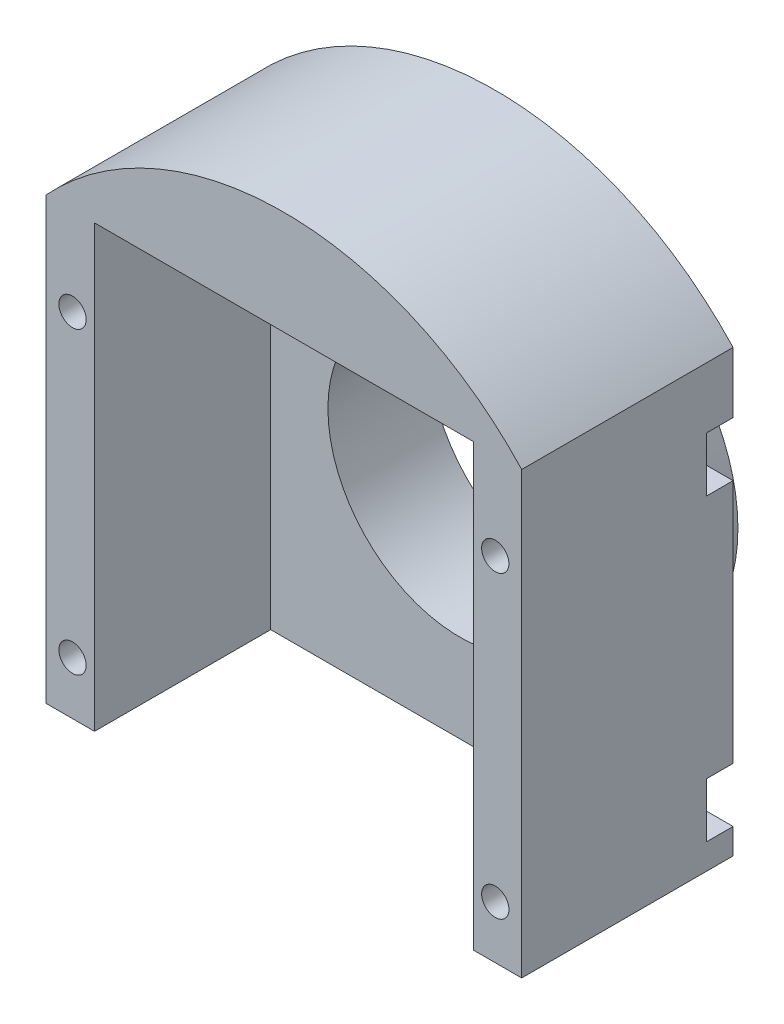
ISO-10303-21;
HEADER;
FILE_DESCRIPTION(('STEP AP214'),'2;1');
FILE_NAME('part.step','',(''),(''),'','','');
FILE_SCHEMA(('AUTOMOTIVE_DESIGN { 1 0 10303 214 1 1 1 1 }'));
ENDSEC;
DATA;
#1=APPLICATION_CONTEXT('core data for automotive mechanical design processes');
#2=APPLICATION_PROTOCOL_DEFINITION('international standard','automotive_design',2000,#1);
#3=PRODUCT_CONTEXT('',#1,'mechanical');
#4=PRODUCT('Part','Part','',(#3));
#5=PRODUCT_RELATED_PRODUCT_CATEGORY('part','',(#4));
#6=PRODUCT_DEFINITION_FORMATION('','',#4);
#7=PRODUCT_DEFINITION_CONTEXT('part definition',#1,'design');
#8=PRODUCT_DEFINITION('design','',#6,#7);
#9=PRODUCT_DEFINITION_SHAPE('','',#8);
#10=(LENGTH_UNIT() NAMED_UNIT(*) SI_UNIT(.MILLI.,.METRE.));
#11=(NAMED_UNIT(*) PLANE_ANGLE_UNIT() SI_UNIT($,.RADIAN.));
#12=(NAMED_UNIT(*) SI_UNIT($,.STERADIAN.) SOLID_ANGLE_UNIT());
#13=UNCERTAINTY_MEASURE_WITH_UNIT(LENGTH_MEASURE(1.E-05),#10,'distance_accuracy_value','');
#14=(GEOMETRIC_REPRESENTATION_CONTEXT(3) GLOBAL_UNCERTAINTY_ASSIGNED_CONTEXT((#13)) GLOBAL_UNIT_ASSIGNED_CONTEXT((#10,
#11,#12)) REPRESENTATION_CONTEXT('',''));
#15=CARTESIAN_POINT('',(0.,0.,0.));
#16=DIRECTION('',(0.,0.,1.));
#17=DIRECTION('',(1.,0.,0.));
#18=AXIS2_PLACEMENT_3D('',#15,#16,#17);
#19=CARTESIAN_POINT('',(0.,0.,0.));
#20=DIRECTION('',(0.,0.,1.));
#21=DIRECTION('',(1.,0.,0.));
#22=AXIS2_PLACEMENT_3D('',#19,#20,#21);
#23=PLANE('',#22);
#24=CARTESIAN_POINT('',(0.,0.,0.));
#25=DIRECTION('',(0.,0.,1.));
#26=DIRECTION('',(1.,0.,0.));
#27=AXIS2_PLACEMENT_3D('',#24,#25,#26);
#28=CIRCLE('',#27,21.);
#29=CARTESIAN_POINT('',(21.,0.,0.));
#30=VERTEX_POINT('',#29);
#31=EDGE_CURVE('E11',#30,#30,#28,.F.);
#32=ORIENTED_EDGE('',*,*,#31,.F.);
#33=EDGE_LOOP('',(#32));
#34=FACE_BOUND('',#33,.T.);
#35=DIRECTION('',(0.,1.,0.));
#36=VECTOR('',#35,1.);
#37=CARTESIAN_POINT('',(27.,25.,0.));
#38=LINE('',#37,#36);
#39=CARTESIAN_POINT('',(27.,18.1,0.));
#40=VERTEX_POINT('',#39);
#41=CARTESIAN_POINT('',(27.,25.,0.));
#42=VERTEX_POINT('',#41);
#43=EDGE_CURVE('E427',#40,#42,#38,.T.);
#44=ORIENTED_EDGE('',*,*,#43,.F.);
#45=DIRECTION('',(1.,0.,0.));
#46=VECTOR('',#45,1.);
#47=CARTESIAN_POINT('',(27.,18.1,0.));
#48=LINE('',#47,#46);
#49=CARTESIAN_POINT('',(24.,18.1,0.));
#50=VERTEX_POINT('',#49);
#51=EDGE_CURVE('E315',#50,#40,#48,.T.);
#52=ORIENTED_EDGE('',*,*,#51,.F.);
#53=CARTESIAN_POINT('',(24.,15.,0.));
#54=DIRECTION('',(0.,0.,-1.));
#55=DIRECTION('',(1.,0.,0.));
#56=AXIS2_PLACEMENT_3D('',#53,#54,#55);
#57=CIRCLE('',#56,3.1);
#58=CARTESIAN_POINT('',(24.,11.9,0.));
#59=VERTEX_POINT('',#58);
#60=EDGE_CURVE('E308',#59,#50,#57,.T.);
#61=ORIENTED_EDGE('',*,*,#60,.F.);
#62=DIRECTION('',(-1.,0.,0.));
#63=VECTOR('',#62,1.);
#64=CARTESIAN_POINT('',(24.,11.9,0.));
#65=LINE('',#64,#63);
#66=CARTESIAN_POINT('',(27.,11.9,0.));
#67=VERTEX_POINT('',#66);
#68=EDGE_CURVE('E311',#67,#59,#65,.T.);
#69=ORIENTED_EDGE('',*,*,#68,.F.);
#70=CARTESIAN_POINT('',(27.,-15.9,0.));
#71=VERTEX_POINT('',#70);
#72=EDGE_CURVE('E607',#71,#67,#38,.T.);
#73=ORIENTED_EDGE('',*,*,#72,.F.);
#74=DIRECTION('',(1.,0.,0.));
#75=VECTOR('',#74,1.);
#76=CARTESIAN_POINT('',(27.,-15.9,0.));
#77=LINE('',#76,#75);
#78=CARTESIAN_POINT('',(24.,-15.9,0.));
#79=VERTEX_POINT('',#78);
#80=EDGE_CURVE('E357',#79,#71,#77,.T.);
#81=ORIENTED_EDGE('',*,*,#80,.F.);
#82=CARTESIAN_POINT('',(24.,-19.,0.));
#83=DIRECTION('',(0.,0.,-1.));
#84=DIRECTION('',(1.,0.,0.));
#85=AXIS2_PLACEMENT_3D('',#82,#83,#84);
#86=CIRCLE('',#85,3.1);
#87=CARTESIAN_POINT('',(24.,-22.1,0.));
#88=VERTEX_POINT('',#87);
#89=EDGE_CURVE('E369',#88,#79,#86,.T.);
#90=ORIENTED_EDGE('',*,*,#89,.F.);
#91=DIRECTION('',(-1.,0.,0.));
#92=VECTOR('',#91,1.);
#93=CARTESIAN_POINT('',(24.,-22.1,0.));
#94=LINE('',#93,#92);
#95=CARTESIAN_POINT('',(27.,-22.1,0.));
#96=VERTEX_POINT('',#95);
#97=EDGE_CURVE('E317',#96,#88,#94,.T.);
#98=ORIENTED_EDGE('',*,*,#97,.F.);
#99=CARTESIAN_POINT('',(27.,-25.,0.));
#100=VERTEX_POINT('',#99);
#101=EDGE_CURVE('E232',#100,#96,#38,.T.);
#102=ORIENTED_EDGE('',*,*,#101,.F.);
#103=DIRECTION('',(1.,0.,0.));
#104=VECTOR('',#103,1.);
#105=CARTESIAN_POINT('',(-27.,-25.,0.));
#106=LINE('',#105,#104);
#107=CARTESIAN_POINT('',(-27.,-25.,0.));
#108=VERTEX_POINT('',#107);
#109=EDGE_CURVE('E231',#108,#100,#106,.T.);
#110=ORIENTED_EDGE('',*,*,#109,.F.);
#111=DIRECTION('',(0.,-1.,0.));
#112=VECTOR('',#111,1.);
#113=CARTESIAN_POINT('',(-27.,25.,0.));
#114=LINE('',#113,#112);
#115=CARTESIAN_POINT('',(-27.,-22.1,0.));
#116=VERTEX_POINT('',#115);
#117=EDGE_CURVE('E228',#116,#108,#114,.T.);
#118=ORIENTED_EDGE('',*,*,#117,.F.);
#119=DIRECTION('',(-1.,0.,0.));
#120=VECTOR('',#119,1.);
#121=CARTESIAN_POINT('',(-24.,-22.1,0.));
#122=LINE('',#121,#120);
#123=CARTESIAN_POINT('',(-24.,-22.1,0.));
#124=VERTEX_POINT('',#123);
#125=EDGE_CURVE('E336',#124,#116,#122,.T.);
#126=ORIENTED_EDGE('',*,*,#125,.F.);
#127=CARTESIAN_POINT('',(-24.,-19.,0.));
#128=DIRECTION('',(0.,0.,-1.));
#129=DIRECTION('',(-1.,0.,0.));
#130=AXIS2_PLACEMENT_3D('',#127,#128,#129);
#131=CIRCLE('',#130,3.1);
#132=CARTESIAN_POINT('',(-24.,-15.9,0.));
#133=VERTEX_POINT('',#132);
#134=EDGE_CURVE('E338',#133,#124,#131,.T.);
#135=ORIENTED_EDGE('',*,*,#134,.F.);
#136=DIRECTION('',(1.,0.,0.));
#137=VECTOR('',#136,1.);
#138=CARTESIAN_POINT('',(-27.,-15.9,0.));
#139=LINE('',#138,#137);
#140=CARTESIAN_POINT('',(-27.,-15.9,0.));
#141=VERTEX_POINT('',#140);
#142=EDGE_CURVE('E226',#141,#133,#139,.T.);
#143=ORIENTED_EDGE('',*,*,#142,.F.);
#144=CARTESIAN_POINT('',(-27.,11.9,0.));
#145=VERTEX_POINT('',#144);
#146=EDGE_CURVE('E220',#145,#141,#114,.T.);
#147=ORIENTED_EDGE('',*,*,#146,.F.);
#148=DIRECTION('',(-1.,0.,0.));
#149=VECTOR('',#148,1.);
#150=CARTESIAN_POINT('',(-24.,11.9,0.));
#151=LINE('',#150,#149);
#152=CARTESIAN_POINT('',(-24.,11.9,0.));
#153=VERTEX_POINT('',#152);
#154=EDGE_CURVE('E201',#153,#145,#151,.T.);
#155=ORIENTED_EDGE('',*,*,#154,.F.);
#156=CARTESIAN_POINT('',(-24.,15.,0.));
#157=DIRECTION('',(0.,0.,-1.));
#158=DIRECTION('',(-1.,0.,0.));
#159=AXIS2_PLACEMENT_3D('',#156,#157,#158);
#160=CIRCLE('',#159,3.1);
#161=CARTESIAN_POINT('',(-24.,18.1,0.));
#162=VERTEX_POINT('',#161);
#163=EDGE_CURVE('E212',#162,#153,#160,.T.);
#164=ORIENTED_EDGE('',*,*,#163,.F.);
#165=DIRECTION('',(1.,0.,0.));
#166=VECTOR('',#165,1.);
#167=CARTESIAN_POINT('',(-27.,18.1,0.));
#168=LINE('',#167,#166);
#169=CARTESIAN_POINT('',(-27.,18.1,0.));
#170=VERTEX_POINT('',#169);
#171=EDGE_CURVE('E287',#170,#162,#168,.T.);
#172=ORIENTED_EDGE('',*,*,#171,.F.);
#173=CARTESIAN_POINT('',(-27.,25.,0.));
#174=VERTEX_POINT('',#173);
#175=EDGE_CURVE('E227',#174,#170,#114,.T.);
#176=ORIENTED_EDGE('',*,*,#175,.F.);
#177=CARTESIAN_POINT('',(0.,-0.00479953928845048,0.));
#178=DIRECTION('',(0.,0.,1.));
#179=DIRECTION('',(1.,0.,0.));
#180=AXIS2_PLACEMENT_3D('',#177,#178,#179);
#181=CIRCLE('',#180,36.8);
#182=EDGE_CURVE('E410',#174,#42,#181,.F.);
#183=ORIENTED_EDGE('',*,*,#182,.T.);
#184=EDGE_LOOP('',(#44,#52,#61,#69,#73,#81,#90,#98,#102,#110,#118,#126,#135,#143,#147,#155,#164,
#172,#176,#183));
#185=FACE_BOUND('',#184,.T.);
#186=ADVANCED_FACE('F39',(#34,#185),#23,.F.);
#187=CARTESIAN_POINT('',(-24.,15.,0.));
#188=DIRECTION('',(0.,0.,1.));
#189=DIRECTION('',(1.,0.,0.));
#190=AXIS2_PLACEMENT_3D('',#187,#188,#189);
#191=CYLINDRICAL_SURFACE('',#190,1.55);
#192=CARTESIAN_POINT('',(-24.,15.,24.));
#193=DIRECTION('',(0.,0.,1.));
#194=DIRECTION('',(1.,0.,0.));
#195=AXIS2_PLACEMENT_3D('',#192,#193,#194);
#196=CIRCLE('',#195,1.55);
#197=CARTESIAN_POINT('',(-22.45,15.,24.));
#198=VERTEX_POINT('',#197);
#199=EDGE_CURVE('E419',#198,#198,#196,.T.);
#200=ORIENTED_EDGE('',*,*,#199,.T.);
#201=EDGE_LOOP('',(#200));
#202=FACE_BOUND('',#201,.T.);
#203=CARTESIAN_POINT('',(-24.,15.,3.));
#204=DIRECTION('',(0.,0.,-1.));
#205=DIRECTION('',(-1.,0.,0.));
#206=AXIS2_PLACEMENT_3D('',#203,#204,#205);
#207=CIRCLE('',#206,1.55);
#208=CARTESIAN_POINT('',(-25.55,15.,3.));
#209=VERTEX_POINT('',#208);
#210=EDGE_CURVE('E260',#209,#209,#207,.F.);
#211=ORIENTED_EDGE('',*,*,#210,.F.);
#212=EDGE_LOOP('',(#211));
#213=FACE_BOUND('',#212,.T.);
#214=ADVANCED_FACE('F477',(#202,#213),#191,.F.);
#215=CARTESIAN_POINT('',(-24.,-19.,0.));
#216=DIRECTION('',(0.,0.,1.));
#217=DIRECTION('',(1.,0.,0.));
#218=AXIS2_PLACEMENT_3D('',#215,#216,#217);
#219=CYLINDRICAL_SURFACE('',#218,1.55);
#220=CARTESIAN_POINT('',(-24.,-19.,24.));
#221=DIRECTION('',(0.,0.,1.));
#222=DIRECTION('',(1.,0.,0.));
#223=AXIS2_PLACEMENT_3D('',#220,#221,#222);
#224=CIRCLE('',#223,1.55);
#225=CARTESIAN_POINT('',(-22.45,-19.,24.));
#226=VERTEX_POINT('',#225);
#227=EDGE_CURVE('E413',#226,#226,#224,.T.);
#228=ORIENTED_EDGE('',*,*,#227,.T.);
#229=EDGE_LOOP('',(#228));
#230=FACE_BOUND('',#229,.T.);
#231=CARTESIAN_POINT('',(-24.,-19.,3.));
#232=DIRECTION('',(0.,0.,-1.));
#233=DIRECTION('',(-1.,0.,0.));
#234=AXIS2_PLACEMENT_3D('',#231,#232,#233);
#235=CIRCLE('',#234,1.55);
#236=CARTESIAN_POINT('',(-25.55,-19.,3.));
#237=VERTEX_POINT('',#236);
#238=EDGE_CURVE('E250',#237,#237,#235,.F.);
#239=ORIENTED_EDGE('',*,*,#238,.F.);
#240=EDGE_LOOP('',(#239));
#241=FACE_BOUND('',#240,.T.);
#242=ADVANCED_FACE('F483',(#230,#241),#219,.F.);
#243=CARTESIAN_POINT('',(-27.,-25.,24.));
#244=DIRECTION('',(0.,1.,0.));
#245=DIRECTION('',(0.,0.,1.));
#246=AXIS2_PLACEMENT_3D('',#243,#244,#245);
#247=PLANE('',#246);
#248=DIRECTION('',(0.,0.,1.));
#249=VECTOR('',#248,1.);
#250=CARTESIAN_POINT('',(21.5,-25.,4.));
#251=LINE('',#250,#249);
#252=CARTESIAN_POINT('',(21.5,-25.,4.));
#253=VERTEX_POINT('',#252);
#254=CARTESIAN_POINT('',(21.5,-25.,24.));
#255=VERTEX_POINT('',#254);
#256=EDGE_CURVE('E403',#253,#255,#251,.T.);
#257=ORIENTED_EDGE('',*,*,#256,.F.);
#258=DIRECTION('',(1.,0.,0.));
#259=VECTOR('',#258,1.);
#260=CARTESIAN_POINT('',(0.,-25.,4.));
#261=LINE('',#260,#259);
#262=CARTESIAN_POINT('',(-21.5,-25.,4.));
#263=VERTEX_POINT('',#262);
#264=EDGE_CURVE('E386',#263,#253,#261,.T.);
#265=ORIENTED_EDGE('',*,*,#264,.F.);
#266=DIRECTION('',(0.,0.,1.));
#267=VECTOR('',#266,1.);
#268=CARTESIAN_POINT('',(-21.5,-25.,4.));
#269=LINE('',#268,#267);
#270=CARTESIAN_POINT('',(-21.5,-25.,24.));
#271=VERTEX_POINT('',#270);
#272=EDGE_CURVE('E405',#263,#271,#269,.T.);
#273=ORIENTED_EDGE('',*,*,#272,.T.);
#274=DIRECTION('',(1.,0.,0.));
#275=VECTOR('',#274,1.);
#276=CARTESIAN_POINT('',(-27.,-25.,24.));
#277=LINE('',#276,#275);
#278=CARTESIAN_POINT('',(-27.,-25.,24.));
#279=VERTEX_POINT('',#278);
#280=EDGE_CURVE('E242',#279,#271,#277,.T.);
#281=ORIENTED_EDGE('',*,*,#280,.F.);
#282=DIRECTION('',(0.,0.,-1.));
#283=VECTOR('',#282,1.);
#284=CARTESIAN_POINT('',(-27.,-25.,24.));
#285=LINE('',#284,#283);
#286=EDGE_CURVE('E241',#279,#108,#285,.T.);
#287=ORIENTED_EDGE('',*,*,#286,.T.);
#288=ORIENTED_EDGE('',*,*,#109,.T.);
#289=DIRECTION('',(0.,0.,-1.));
#290=VECTOR('',#289,1.);
#291=CARTESIAN_POINT('',(27.,-25.,24.));
#292=LINE('',#291,#290);
#293=CARTESIAN_POINT('',(27.,-25.,24.));
#294=VERTEX_POINT('',#293);
#295=EDGE_CURVE('E238',#294,#100,#292,.T.);
#296=ORIENTED_EDGE('',*,*,#295,.F.);
#297=EDGE_CURVE('E430',#255,#294,#277,.T.);
#298=ORIENTED_EDGE('',*,*,#297,.F.);
#299=EDGE_LOOP('',(#257,#265,#273,#281,#287,#288,#296,#298));
#300=FACE_BOUND('',#299,.T.);
#301=ADVANCED_FACE('F441',(#300),#247,.F.);
#302=CARTESIAN_POINT('',(0.,0.,24.));
#303=DIRECTION('',(0.,0.,1.));
#304=DIRECTION('',(1.,0.,0.));
#305=AXIS2_PLACEMENT_3D('',#302,#303,#304);
#306=PLANE('',#305);
#307=ORIENTED_EDGE('',*,*,#227,.F.);
#308=EDGE_LOOP('',(#307));
#309=FACE_BOUND('',#308,.T.);
#310=CARTESIAN_POINT('',(24.,-19.,24.));
#311=DIRECTION('',(0.,0.,1.));
#312=DIRECTION('',(1.,0.,0.));
#313=AXIS2_PLACEMENT_3D('',#310,#311,#312);
#314=CIRCLE('',#313,1.55000000000001);
#315=CARTESIAN_POINT('',(25.55,-19.,24.));
#316=VERTEX_POINT('',#315);
#317=EDGE_CURVE('E420',#316,#316,#314,.T.);
#318=ORIENTED_EDGE('',*,*,#317,.F.);
#319=EDGE_LOOP('',(#318));
#320=FACE_BOUND('',#319,.T.);
#321=CARTESIAN_POINT('',(24.,15.,24.));
#322=DIRECTION('',(0.,0.,1.));
#323=DIRECTION('',(1.,0.,0.));
#324=AXIS2_PLACEMENT_3D('',#321,#322,#323);
#325=CIRCLE('',#324,1.55000000000001);
#326=CARTESIAN_POINT('',(25.55,15.,24.));
#327=VERTEX_POINT('',#326);
#328=EDGE_CURVE('E416',#327,#327,#325,.T.);
#329=ORIENTED_EDGE('',*,*,#328,.F.);
#330=EDGE_LOOP('',(#329));
#331=FACE_BOUND('',#330,.T.);
#332=ORIENTED_EDGE('',*,*,#199,.F.);
#333=EDGE_LOOP('',(#332));
#334=FACE_BOUND('',#333,.T.);
#335=DIRECTION('',(1.,0.,0.));
#336=VECTOR('',#335,1.);
#337=CARTESIAN_POINT('',(0.,25.,24.));
#338=LINE('',#337,#336);
#339=CARTESIAN_POINT('',(-21.5,25.,24.));
#340=VERTEX_POINT('',#339);
#341=CARTESIAN_POINT('',(21.5,25.,24.));
#342=VERTEX_POINT('',#341);
#343=EDGE_CURVE('E263',#340,#342,#338,.T.);
#344=ORIENTED_EDGE('',*,*,#343,.T.);
#345=DIRECTION('',(0.,-1.,0.));
#346=VECTOR('',#345,1.);
#347=CARTESIAN_POINT('',(21.5,0.,24.));
#348=LINE('',#347,#346);
#349=EDGE_CURVE('E384',#342,#255,#348,.T.);
#350=ORIENTED_EDGE('',*,*,#349,.T.);
#351=ORIENTED_EDGE('',*,*,#297,.T.);
#352=DIRECTION('',(0.,1.,0.));
#353=VECTOR('',#352,1.);
#354=CARTESIAN_POINT('',(27.,25.,24.));
#355=LINE('',#354,#353);
#356=CARTESIAN_POINT('',(27.,25.,24.));
#357=VERTEX_POINT('',#356);
#358=EDGE_CURVE('E237',#294,#357,#355,.T.);
#359=ORIENTED_EDGE('',*,*,#358,.T.);
#360=CARTESIAN_POINT('',(0.,-0.00479953928845048,24.));
#361=DIRECTION('',(0.,0.,1.));
#362=DIRECTION('',(-1.,0.,0.));
#363=AXIS2_PLACEMENT_3D('',#360,#361,#362);
#364=CIRCLE('',#363,36.8);
#365=CARTESIAN_POINT('',(-27.,25.,24.));
#366=VERTEX_POINT('',#365);
#367=EDGE_CURVE('E402',#357,#366,#364,.T.);
#368=ORIENTED_EDGE('',*,*,#367,.T.);
#369=DIRECTION('',(0.,-1.,0.));
#370=VECTOR('',#369,1.);
#371=CARTESIAN_POINT('',(-27.,25.,24.));
#372=LINE('',#371,#370);
#373=EDGE_CURVE('E429',#366,#279,#372,.T.);
#374=ORIENTED_EDGE('',*,*,#373,.T.);
#375=ORIENTED_EDGE('',*,*,#280,.T.);
#376=DIRECTION('',(0.,1.,0.));
#377=VECTOR('',#376,1.);
#378=CARTESIAN_POINT('',(-21.5,0.,24.));
#379=LINE('',#378,#377);
#380=EDGE_CURVE('E394',#271,#340,#379,.T.);
#381=ORIENTED_EDGE('',*,*,#380,.T.);
#382=EDGE_LOOP('',(#344,#350,#351,#359,#368,#374,#375,#381));
#383=FACE_BOUND('',#382,.T.);
#384=ADVANCED_FACE('F436',(#309,#320,#331,#334,#383),#306,.T.);
#385=CARTESIAN_POINT('',(27.,25.,24.));
#386=DIRECTION('',(-1.,0.,0.));
#387=DIRECTION('',(0.,0.,1.));
#388=AXIS2_PLACEMENT_3D('',#385,#386,#387);
#389=PLANE('',#388);
#390=DIRECTION('',(0.,-1.,0.));
#391=VECTOR('',#390,1.);
#392=CARTESIAN_POINT('',(27.,18.1,3.));
#393=LINE('',#392,#391);
#394=CARTESIAN_POINT('',(27.,18.1,3.));
#395=VERTEX_POINT('',#394);
#396=CARTESIAN_POINT('',(27.,11.9,3.));
#397=VERTEX_POINT('',#396);
#398=EDGE_CURVE('E323',#395,#397,#393,.T.);
#399=ORIENTED_EDGE('',*,*,#398,.F.);
#400=DIRECTION('',(0.,0.,-1.));
#401=VECTOR('',#400,1.);
#402=CARTESIAN_POINT('',(27.,18.1,3.));
#403=LINE('',#402,#401);
#404=EDGE_CURVE('E298',#395,#40,#403,.T.);
#405=ORIENTED_EDGE('',*,*,#404,.T.);
#406=ORIENTED_EDGE('',*,*,#43,.T.);
#407=DIRECTION('',(0.,0.,-1.));
#408=VECTOR('',#407,1.);
#409=CARTESIAN_POINT('',(27.,25.,24.));
#410=LINE('',#409,#408);
#411=EDGE_CURVE('E47',#357,#42,#410,.T.);
#412=ORIENTED_EDGE('',*,*,#411,.F.);
#413=ORIENTED_EDGE('',*,*,#358,.F.);
#414=ORIENTED_EDGE('',*,*,#295,.T.);
#415=ORIENTED_EDGE('',*,*,#101,.T.);
#416=DIRECTION('',(0.,0.,-1.));
#417=VECTOR('',#416,1.);
#418=CARTESIAN_POINT('',(27.,-22.1,3.));
#419=LINE('',#418,#417);
#420=CARTESIAN_POINT('',(27.,-22.1,3.));
#421=VERTEX_POINT('',#420);
#422=EDGE_CURVE('E366',#421,#96,#419,.T.);
#423=ORIENTED_EDGE('',*,*,#422,.F.);
#424=DIRECTION('',(0.,-1.,0.));
#425=VECTOR('',#424,1.);
#426=CARTESIAN_POINT('',(27.,-15.9,3.));
#427=LINE('',#426,#425);
#428=CARTESIAN_POINT('',(27.,-15.9,3.));
#429=VERTEX_POINT('',#428);
#430=EDGE_CURVE('E353',#429,#421,#427,.T.);
#431=ORIENTED_EDGE('',*,*,#430,.F.);
#432=DIRECTION('',(0.,0.,-1.));
#433=VECTOR('',#432,1.);
#434=CARTESIAN_POINT('',(27.,-15.9,3.));
#435=LINE('',#434,#433);
#436=EDGE_CURVE('E254',#429,#71,#435,.T.);
#437=ORIENTED_EDGE('',*,*,#436,.T.);
#438=ORIENTED_EDGE('',*,*,#72,.T.);
#439=DIRECTION('',(0.,0.,-1.));
#440=VECTOR('',#439,1.);
#441=CARTESIAN_POINT('',(27.,11.9,3.));
#442=LINE('',#441,#440);
#443=EDGE_CURVE('E302',#397,#67,#442,.T.);
#444=ORIENTED_EDGE('',*,*,#443,.F.);
#445=EDGE_LOOP('',(#399,#405,#406,#412,#413,#414,#415,#423,#431,#437,#438,#444));
#446=FACE_BOUND('',#445,.T.);
#447=ADVANCED_FACE('F41',(#446),#389,.F.);
#448=CARTESIAN_POINT('',(-27.,25.,24.));
#449=DIRECTION('',(1.,0.,0.));
#450=DIRECTION('',(0.,0.,-1.));
#451=AXIS2_PLACEMENT_3D('',#448,#449,#450);
#452=PLANE('',#451);
#453=DIRECTION('',(0.,1.,0.));
#454=VECTOR('',#453,1.);
#455=CARTESIAN_POINT('',(-27.,-15.9,3.));
#456=LINE('',#455,#454);
#457=CARTESIAN_POINT('',(-27.,-22.1,3.));
#458=VERTEX_POINT('',#457);
#459=CARTESIAN_POINT('',(-27.,-15.9,3.));
#460=VERTEX_POINT('',#459);
#461=EDGE_CURVE('E339',#458,#460,#456,.T.);
#462=ORIENTED_EDGE('',*,*,#461,.F.);
#463=DIRECTION('',(0.,0.,-1.));
#464=VECTOR('',#463,1.);
#465=CARTESIAN_POINT('',(-27.,-22.1,3.));
#466=LINE('',#465,#464);
#467=EDGE_CURVE('E289',#458,#116,#466,.T.);
#468=ORIENTED_EDGE('',*,*,#467,.T.);
#469=ORIENTED_EDGE('',*,*,#117,.T.);
#470=ORIENTED_EDGE('',*,*,#286,.F.);
#471=ORIENTED_EDGE('',*,*,#373,.F.);
#472=DIRECTION('',(0.,0.,-1.));
#473=VECTOR('',#472,1.);
#474=CARTESIAN_POINT('',(-27.,25.,24.));
#475=LINE('',#474,#473);
#476=EDGE_CURVE('E245',#366,#174,#475,.T.);
#477=ORIENTED_EDGE('',*,*,#476,.T.);
#478=ORIENTED_EDGE('',*,*,#175,.T.);
#479=DIRECTION('',(0.,0.,-1.));
#480=VECTOR('',#479,1.);
#481=CARTESIAN_POINT('',(-27.,18.1,3.));
#482=LINE('',#481,#480);
#483=CARTESIAN_POINT('',(-27.,18.1,3.));
#484=VERTEX_POINT('',#483);
#485=EDGE_CURVE('E62',#484,#170,#482,.T.);
#486=ORIENTED_EDGE('',*,*,#485,.F.);
#487=DIRECTION('',(0.,1.,0.));
#488=VECTOR('',#487,1.);
#489=CARTESIAN_POINT('',(-27.,18.1,3.));
#490=LINE('',#489,#488);
#491=CARTESIAN_POINT('',(-27.,11.9,3.));
#492=VERTEX_POINT('',#491);
#493=EDGE_CURVE('E213',#492,#484,#490,.T.);
#494=ORIENTED_EDGE('',*,*,#493,.F.);
#495=DIRECTION('',(0.,0.,-1.));
#496=VECTOR('',#495,1.);
#497=CARTESIAN_POINT('',(-27.,11.9,3.));
#498=LINE('',#497,#496);
#499=EDGE_CURVE('E205',#492,#145,#498,.T.);
#500=ORIENTED_EDGE('',*,*,#499,.T.);
#501=ORIENTED_EDGE('',*,*,#146,.T.);
#502=DIRECTION('',(0.,0.,-1.));
#503=VECTOR('',#502,1.);
#504=CARTESIAN_POINT('',(-27.,-15.9,3.));
#505=LINE('',#504,#503);
#506=EDGE_CURVE('E54',#460,#141,#505,.T.);
#507=ORIENTED_EDGE('',*,*,#506,.F.);
#508=EDGE_LOOP('',(#462,#468,#469,#470,#471,#477,#478,#486,#494,#500,#501,#507));
#509=FACE_BOUND('',#508,.T.);
#510=ADVANCED_FACE('F219',(#509),#452,.F.);
#511=CARTESIAN_POINT('',(24.,15.,0.));
#512=DIRECTION('',(0.,0.,1.));
#513=DIRECTION('',(1.,0.,0.));
#514=AXIS2_PLACEMENT_3D('',#511,#512,#513);
#515=CYLINDRICAL_SURFACE('',#514,1.55000000000001);
#516=CARTESIAN_POINT('',(24.,15.,3.));
#517=DIRECTION('',(0.,0.,1.));
#518=DIRECTION('',(1.,0.,0.));
#519=AXIS2_PLACEMENT_3D('',#516,#517,#518);
#520=CIRCLE('',#519,1.55000000000001);
#521=CARTESIAN_POINT('',(25.55,15.,3.));
#522=VERTEX_POINT('',#521);
#523=EDGE_CURVE('E257',#522,#522,#520,.F.);
#524=ORIENTED_EDGE('',*,*,#523,.T.);
#525=EDGE_LOOP('',(#524));
#526=FACE_BOUND('',#525,.T.);
#527=ORIENTED_EDGE('',*,*,#328,.T.);
#528=EDGE_LOOP('',(#527));
#529=FACE_BOUND('',#528,.T.);
#530=ADVANCED_FACE('F491',(#526,#529),#515,.F.);
#531=CARTESIAN_POINT('',(24.,-19.,0.));
#532=DIRECTION('',(0.,0.,1.));
#533=DIRECTION('',(1.,0.,0.));
#534=AXIS2_PLACEMENT_3D('',#531,#532,#533);
#535=CYLINDRICAL_SURFACE('',#534,1.55000000000001);
#536=CARTESIAN_POINT('',(24.,-19.,3.));
#537=DIRECTION('',(0.,0.,1.));
#538=DIRECTION('',(1.,0.,0.));
#539=AXIS2_PLACEMENT_3D('',#536,#537,#538);
#540=CIRCLE('',#539,1.55000000000001);
#541=CARTESIAN_POINT('',(25.55,-19.,3.));
#542=VERTEX_POINT('',#541);
#543=EDGE_CURVE('E253',#542,#542,#540,.F.);
#544=ORIENTED_EDGE('',*,*,#543,.T.);
#545=EDGE_LOOP('',(#544));
#546=FACE_BOUND('',#545,.T.);
#547=ORIENTED_EDGE('',*,*,#317,.T.);
#548=EDGE_LOOP('',(#547));
#549=FACE_BOUND('',#548,.T.);
#550=ADVANCED_FACE('F496',(#546,#549),#535,.F.);
#551=CARTESIAN_POINT('',(0.,-0.00479953928845048,-55.2732010463332));
#552=DIRECTION('',(0.,0.,1.));
#553=DIRECTION('',(1.,0.,0.));
#554=AXIS2_PLACEMENT_3D('',#551,#552,#553);
#555=CYLINDRICAL_SURFACE('',#554,36.8);
#556=ORIENTED_EDGE('',*,*,#182,.F.);
#557=ORIENTED_EDGE('',*,*,#476,.F.);
#558=ORIENTED_EDGE('',*,*,#367,.F.);
#559=ORIENTED_EDGE('',*,*,#411,.T.);
#560=EDGE_LOOP('',(#556,#557,#558,#559));
#561=FACE_BOUND('',#560,.T.);
#562=ADVANCED_FACE('F451',(#561),#555,.T.);
#563=CARTESIAN_POINT('',(0.,25.,4.));
#564=DIRECTION('',(0.,-1.,0.));
#565=DIRECTION('',(1.,0.,0.));
#566=AXIS2_PLACEMENT_3D('',#563,#564,#565);
#567=PLANE('',#566);
#568=ORIENTED_EDGE('',*,*,#343,.F.);
#569=DIRECTION('',(0.,0.,1.));
#570=VECTOR('',#569,1.);
#571=CARTESIAN_POINT('',(-21.5,25.,4.));
#572=LINE('',#571,#570);
#573=CARTESIAN_POINT('',(-21.5,25.,4.));
#574=VERTEX_POINT('',#573);
#575=EDGE_CURVE('E391',#574,#340,#572,.T.);
#576=ORIENTED_EDGE('',*,*,#575,.F.);
#577=DIRECTION('',(1.,0.,0.));
#578=VECTOR('',#577,1.);
#579=CARTESIAN_POINT('',(0.,25.,4.));
#580=LINE('',#579,#578);
#581=CARTESIAN_POINT('',(21.5,25.,4.));
#582=VERTEX_POINT('',#581);
#583=EDGE_CURVE('E380',#574,#582,#580,.T.);
#584=ORIENTED_EDGE('',*,*,#583,.T.);
#585=DIRECTION('',(0.,0.,1.));
#586=VECTOR('',#585,1.);
#587=CARTESIAN_POINT('',(21.5,25.,4.));
#588=LINE('',#587,#586);
#589=EDGE_CURVE('E399',#582,#342,#588,.T.);
#590=ORIENTED_EDGE('',*,*,#589,.T.);
#591=EDGE_LOOP('',(#568,#576,#584,#590));
#592=FACE_BOUND('',#591,.T.);
#593=ADVANCED_FACE('F464',(#592),#567,.T.);
#594=CARTESIAN_POINT('',(21.5,0.,4.));
#595=DIRECTION('',(-1.,0.,0.));
#596=DIRECTION('',(0.,-1.,0.));
#597=AXIS2_PLACEMENT_3D('',#594,#595,#596);
#598=PLANE('',#597);
#599=ORIENTED_EDGE('',*,*,#349,.F.);
#600=ORIENTED_EDGE('',*,*,#589,.F.);
#601=DIRECTION('',(0.,-1.,0.));
#602=VECTOR('',#601,1.);
#603=CARTESIAN_POINT('',(21.5,0.,4.));
#604=LINE('',#603,#602);
#605=EDGE_CURVE('E389',#582,#253,#604,.T.);
#606=ORIENTED_EDGE('',*,*,#605,.T.);
#607=ORIENTED_EDGE('',*,*,#256,.T.);
#608=EDGE_LOOP('',(#599,#600,#606,#607));
#609=FACE_BOUND('',#608,.T.);
#610=ADVANCED_FACE('F466',(#609),#598,.T.);
#611=CARTESIAN_POINT('',(-21.5,0.,4.));
#612=DIRECTION('',(1.,0.,0.));
#613=DIRECTION('',(0.,1.,0.));
#614=AXIS2_PLACEMENT_3D('',#611,#612,#613);
#615=PLANE('',#614);
#616=ORIENTED_EDGE('',*,*,#380,.F.);
#617=ORIENTED_EDGE('',*,*,#272,.F.);
#618=DIRECTION('',(0.,1.,0.));
#619=VECTOR('',#618,1.);
#620=CARTESIAN_POINT('',(-21.5,0.,4.));
#621=LINE('',#620,#619);
#622=EDGE_CURVE('E383',#263,#574,#621,.T.);
#623=ORIENTED_EDGE('',*,*,#622,.T.);
#624=ORIENTED_EDGE('',*,*,#575,.T.);
#625=EDGE_LOOP('',(#616,#617,#623,#624));
#626=FACE_BOUND('',#625,.T.);
#627=ADVANCED_FACE('F457',(#626),#615,.T.);
#628=CARTESIAN_POINT('',(0.,0.,4.));
#629=DIRECTION('',(0.,0.,1.));
#630=DIRECTION('',(1.,0.,0.));
#631=AXIS2_PLACEMENT_3D('',#628,#629,#630);
#632=PLANE('',#631);
#633=CARTESIAN_POINT('',(0.,0.,4.));
#634=DIRECTION('',(0.,0.,1.));
#635=DIRECTION('',(1.,0.,0.));
#636=AXIS2_PLACEMENT_3D('',#633,#634,#635);
#637=CIRCLE('',#636,15.);
#638=CARTESIAN_POINT('',(15.,0.,4.));
#639=VERTEX_POINT('',#638);
#640=EDGE_CURVE('E222',#639,#639,#637,.T.);
#641=ORIENTED_EDGE('',*,*,#640,.F.);
#642=EDGE_LOOP('',(#641));
#643=FACE_BOUND('',#642,.T.);
#644=ORIENTED_EDGE('',*,*,#583,.F.);
#645=ORIENTED_EDGE('',*,*,#622,.F.);
#646=ORIENTED_EDGE('',*,*,#264,.T.);
#647=ORIENTED_EDGE('',*,*,#605,.F.);
#648=EDGE_LOOP('',(#644,#645,#646,#647));
#649=FACE_BOUND('',#648,.T.);
#650=ADVANCED_FACE('F461',(#643,#649),#632,.T.);
#651=CARTESIAN_POINT('',(-24.,-19.,3.));
#652=DIRECTION('',(0.,0.,-1.));
#653=DIRECTION('',(-1.,0.,0.));
#654=AXIS2_PLACEMENT_3D('',#651,#652,#653);
#655=PLANE('',#654);
#656=ORIENTED_EDGE('',*,*,#461,.T.);
#657=DIRECTION('',(1.,0.,0.));
#658=VECTOR('',#657,1.);
#659=CARTESIAN_POINT('',(-27.,-15.9,3.));
#660=LINE('',#659,#658);
#661=CARTESIAN_POINT('',(-24.,-15.9,3.));
#662=VERTEX_POINT('',#661);
#663=EDGE_CURVE('E348',#460,#662,#660,.T.);
#664=ORIENTED_EDGE('',*,*,#663,.T.);
#665=CARTESIAN_POINT('',(-24.,-19.,3.));
#666=DIRECTION('',(0.,0.,-1.));
#667=DIRECTION('',(-1.,0.,0.));
#668=AXIS2_PLACEMENT_3D('',#665,#666,#667);
#669=CIRCLE('',#668,3.1);
#670=CARTESIAN_POINT('',(-24.,-22.1,3.));
#671=VERTEX_POINT('',#670);
#672=EDGE_CURVE('E345',#662,#671,#669,.T.);
#673=ORIENTED_EDGE('',*,*,#672,.T.);
#674=DIRECTION('',(-1.,0.,0.));
#675=VECTOR('',#674,1.);
#676=CARTESIAN_POINT('',(-24.,-22.1,3.));
#677=LINE('',#676,#675);
#678=EDGE_CURVE('E329',#671,#458,#677,.T.);
#679=ORIENTED_EDGE('',*,*,#678,.T.);
#680=EDGE_LOOP('',(#656,#664,#673,#679));
#681=FACE_BOUND('',#680,.T.);
#682=ORIENTED_EDGE('',*,*,#238,.T.);
#683=EDGE_LOOP('',(#682));
#684=FACE_BOUND('',#683,.T.);
#685=ADVANCED_FACE('F554',(#681,#684),#655,.T.);
#686=CARTESIAN_POINT('',(-24.,-22.1,3.));
#687=DIRECTION('',(0.,-1.,0.));
#688=DIRECTION('',(0.,0.,-1.));
#689=AXIS2_PLACEMENT_3D('',#686,#687,#688);
#690=PLANE('',#689);
#691=ORIENTED_EDGE('',*,*,#125,.T.);
#692=ORIENTED_EDGE('',*,*,#467,.F.);
#693=ORIENTED_EDGE('',*,*,#678,.F.);
#694=DIRECTION('',(0.,0.,-1.));
#695=VECTOR('',#694,1.);
#696=CARTESIAN_POINT('',(-24.,-22.1,3.));
#697=LINE('',#696,#695);
#698=EDGE_CURVE('E332',#671,#124,#697,.T.);
#699=ORIENTED_EDGE('',*,*,#698,.T.);
#700=EDGE_LOOP('',(#691,#692,#693,#699));
#701=FACE_BOUND('',#700,.T.);
#702=ADVANCED_FACE('F550',(#701),#690,.F.);
#703=CARTESIAN_POINT('',(-24.,-19.,3.));
#704=DIRECTION('',(0.,0.,-1.));
#705=DIRECTION('',(-1.,0.,0.));
#706=AXIS2_PLACEMENT_3D('',#703,#704,#705);
#707=CYLINDRICAL_SURFACE('',#706,3.1);
#708=ORIENTED_EDGE('',*,*,#134,.T.);
#709=ORIENTED_EDGE('',*,*,#698,.F.);
#710=ORIENTED_EDGE('',*,*,#672,.F.);
#711=DIRECTION('',(0.,0.,-1.));
#712=VECTOR('',#711,1.);
#713=CARTESIAN_POINT('',(-24.,-15.9,3.));
#714=LINE('',#713,#712);
#715=EDGE_CURVE('E330',#662,#133,#714,.T.);
#716=ORIENTED_EDGE('',*,*,#715,.T.);
#717=EDGE_LOOP('',(#708,#709,#710,#716));
#718=FACE_BOUND('',#717,.T.);
#719=ADVANCED_FACE('F547',(#718),#707,.F.);
#720=CARTESIAN_POINT('',(-27.,-15.9,3.));
#721=DIRECTION('',(0.,1.,0.));
#722=DIRECTION('',(0.,0.,1.));
#723=AXIS2_PLACEMENT_3D('',#720,#721,#722);
#724=PLANE('',#723);
#725=ORIENTED_EDGE('',*,*,#142,.T.);
#726=ORIENTED_EDGE('',*,*,#715,.F.);
#727=ORIENTED_EDGE('',*,*,#663,.F.);
#728=ORIENTED_EDGE('',*,*,#506,.T.);
#729=EDGE_LOOP('',(#725,#726,#727,#728));
#730=FACE_BOUND('',#729,.T.);
#731=ADVANCED_FACE('F543',(#730),#724,.F.);
#732=CARTESIAN_POINT('',(24.,-19.,3.));
#733=DIRECTION('',(0.,0.,1.));
#734=DIRECTION('',(1.,0.,0.));
#735=AXIS2_PLACEMENT_3D('',#732,#733,#734);
#736=PLANE('',#735);
#737=ORIENTED_EDGE('',*,*,#430,.T.);
#738=DIRECTION('',(-1.,0.,0.));
#739=VECTOR('',#738,1.);
#740=CARTESIAN_POINT('',(24.,-22.1,3.));
#741=LINE('',#740,#739);
#742=CARTESIAN_POINT('',(24.,-22.1,3.));
#743=VERTEX_POINT('',#742);
#744=EDGE_CURVE('E356',#421,#743,#741,.T.);
#745=ORIENTED_EDGE('',*,*,#744,.T.);
#746=CARTESIAN_POINT('',(24.,-19.,3.));
#747=DIRECTION('',(0.,0.,-1.));
#748=DIRECTION('',(1.,0.,0.));
#749=AXIS2_PLACEMENT_3D('',#746,#747,#748);
#750=CIRCLE('',#749,3.1);
#751=CARTESIAN_POINT('',(24.,-15.9,3.));
#752=VERTEX_POINT('',#751);
#753=EDGE_CURVE('E360',#743,#752,#750,.T.);
#754=ORIENTED_EDGE('',*,*,#753,.T.);
#755=DIRECTION('',(1.,0.,0.));
#756=VECTOR('',#755,1.);
#757=CARTESIAN_POINT('',(27.,-15.9,3.));
#758=LINE('',#757,#756);
#759=EDGE_CURVE('E363',#752,#429,#758,.T.);
#760=ORIENTED_EDGE('',*,*,#759,.T.);
#761=EDGE_LOOP('',(#737,#745,#754,#760));
#762=FACE_BOUND('',#761,.T.);
#763=ORIENTED_EDGE('',*,*,#543,.F.);
#764=EDGE_LOOP('',(#763));
#765=FACE_BOUND('',#764,.T.);
#766=ADVANCED_FACE('F546',(#762,#765),#736,.F.);
#767=CARTESIAN_POINT('',(27.,-15.9,3.));
#768=DIRECTION('',(0.,1.,0.));
#769=DIRECTION('',(0.,0.,1.));
#770=AXIS2_PLACEMENT_3D('',#767,#768,#769);
#771=PLANE('',#770);
#772=ORIENTED_EDGE('',*,*,#80,.T.);
#773=ORIENTED_EDGE('',*,*,#436,.F.);
#774=ORIENTED_EDGE('',*,*,#759,.F.);
#775=DIRECTION('',(0.,0.,-1.));
#776=VECTOR('',#775,1.);
#777=CARTESIAN_POINT('',(24.,-15.9,3.));
#778=LINE('',#777,#776);
#779=EDGE_CURVE('E375',#752,#79,#778,.T.);
#780=ORIENTED_EDGE('',*,*,#779,.T.);
#781=EDGE_LOOP('',(#772,#773,#774,#780));
#782=FACE_BOUND('',#781,.T.);
#783=ADVANCED_FACE('F561',(#782),#771,.F.);
#784=CARTESIAN_POINT('',(24.,-19.,3.));
#785=DIRECTION('',(0.,0.,-1.));
#786=DIRECTION('',(-1.,0.,0.));
#787=AXIS2_PLACEMENT_3D('',#784,#785,#786);
#788=CYLINDRICAL_SURFACE('',#787,3.1);
#789=ORIENTED_EDGE('',*,*,#89,.T.);
#790=ORIENTED_EDGE('',*,*,#779,.F.);
#791=ORIENTED_EDGE('',*,*,#753,.F.);
#792=DIRECTION('',(0.,0.,-1.));
#793=VECTOR('',#792,1.);
#794=CARTESIAN_POINT('',(24.,-22.1,3.));
#795=LINE('',#794,#793);
#796=EDGE_CURVE('E377',#743,#88,#795,.T.);
#797=ORIENTED_EDGE('',*,*,#796,.T.);
#798=EDGE_LOOP('',(#789,#790,#791,#797));
#799=FACE_BOUND('',#798,.T.);
#800=ADVANCED_FACE('F565',(#799),#788,.F.);
#801=CARTESIAN_POINT('',(24.,-22.1,3.));
#802=DIRECTION('',(0.,-1.,0.));
#803=DIRECTION('',(0.,0.,-1.));
#804=AXIS2_PLACEMENT_3D('',#801,#802,#803);
#805=PLANE('',#804);
#806=ORIENTED_EDGE('',*,*,#97,.T.);
#807=ORIENTED_EDGE('',*,*,#796,.F.);
#808=ORIENTED_EDGE('',*,*,#744,.F.);
#809=ORIENTED_EDGE('',*,*,#422,.T.);
#810=EDGE_LOOP('',(#806,#807,#808,#809));
#811=FACE_BOUND('',#810,.T.);
#812=ADVANCED_FACE('F541',(#811),#805,.F.);
#813=CARTESIAN_POINT('',(24.,15.,3.));
#814=DIRECTION('',(0.,0.,1.));
#815=DIRECTION('',(1.,0.,0.));
#816=AXIS2_PLACEMENT_3D('',#813,#814,#815);
#817=PLANE('',#816);
#818=DIRECTION('',(1.,0.,0.));
#819=VECTOR('',#818,1.);
#820=CARTESIAN_POINT('',(27.,18.1,3.));
#821=LINE('',#820,#819);
#822=CARTESIAN_POINT('',(24.,18.1,3.));
#823=VERTEX_POINT('',#822);
#824=EDGE_CURVE('E312',#823,#395,#821,.T.);
#825=ORIENTED_EDGE('',*,*,#824,.T.);
#826=ORIENTED_EDGE('',*,*,#398,.T.);
#827=DIRECTION('',(-1.,0.,0.));
#828=VECTOR('',#827,1.);
#829=CARTESIAN_POINT('',(24.,11.9,3.));
#830=LINE('',#829,#828);
#831=CARTESIAN_POINT('',(24.,11.9,3.));
#832=VERTEX_POINT('',#831);
#833=EDGE_CURVE('E320',#397,#832,#830,.T.);
#834=ORIENTED_EDGE('',*,*,#833,.T.);
#835=CARTESIAN_POINT('',(24.,15.,3.));
#836=DIRECTION('',(0.,0.,-1.));
#837=DIRECTION('',(1.,0.,0.));
#838=AXIS2_PLACEMENT_3D('',#835,#836,#837);
#839=CIRCLE('',#838,3.1);
#840=EDGE_CURVE('E301',#832,#823,#839,.T.);
#841=ORIENTED_EDGE('',*,*,#840,.T.);
#842=EDGE_LOOP('',(#825,#826,#834,#841));
#843=FACE_BOUND('',#842,.T.);
#844=ORIENTED_EDGE('',*,*,#523,.F.);
#845=EDGE_LOOP('',(#844));
#846=FACE_BOUND('',#845,.T.);
#847=ADVANCED_FACE('F533',(#843,#846),#817,.F.);
#848=CARTESIAN_POINT('',(27.,18.1,3.));
#849=DIRECTION('',(0.,1.,0.));
#850=DIRECTION('',(0.,0.,1.));
#851=AXIS2_PLACEMENT_3D('',#848,#849,#850);
#852=PLANE('',#851);
#853=ORIENTED_EDGE('',*,*,#51,.T.);
#854=ORIENTED_EDGE('',*,*,#404,.F.);
#855=ORIENTED_EDGE('',*,*,#824,.F.);
#856=DIRECTION('',(0.,0.,-1.));
#857=VECTOR('',#856,1.);
#858=CARTESIAN_POINT('',(24.,18.1,3.));
#859=LINE('',#858,#857);
#860=EDGE_CURVE('E306',#823,#50,#859,.T.);
#861=ORIENTED_EDGE('',*,*,#860,.T.);
#862=EDGE_LOOP('',(#853,#854,#855,#861));
#863=FACE_BOUND('',#862,.T.);
#864=ADVANCED_FACE('F531',(#863),#852,.F.);
#865=CARTESIAN_POINT('',(24.,15.,3.));
#866=DIRECTION('',(0.,0.,-1.));
#867=DIRECTION('',(-1.,0.,0.));
#868=AXIS2_PLACEMENT_3D('',#865,#866,#867);
#869=CYLINDRICAL_SURFACE('',#868,3.1);
#870=ORIENTED_EDGE('',*,*,#60,.T.);
#871=ORIENTED_EDGE('',*,*,#860,.F.);
#872=ORIENTED_EDGE('',*,*,#840,.F.);
#873=DIRECTION('',(0.,0.,-1.));
#874=VECTOR('',#873,1.);
#875=CARTESIAN_POINT('',(24.,11.9,3.));
#876=LINE('',#875,#874);
#877=EDGE_CURVE('E304',#832,#59,#876,.T.);
#878=ORIENTED_EDGE('',*,*,#877,.T.);
#879=EDGE_LOOP('',(#870,#871,#872,#878));
#880=FACE_BOUND('',#879,.T.);
#881=ADVANCED_FACE('F526',(#880),#869,.F.);
#882=CARTESIAN_POINT('',(24.,11.9,3.));
#883=DIRECTION('',(0.,-1.,0.));
#884=DIRECTION('',(0.,0.,-1.));
#885=AXIS2_PLACEMENT_3D('',#882,#883,#884);
#886=PLANE('',#885);
#887=ORIENTED_EDGE('',*,*,#68,.T.);
#888=ORIENTED_EDGE('',*,*,#877,.F.);
#889=ORIENTED_EDGE('',*,*,#833,.F.);
#890=ORIENTED_EDGE('',*,*,#443,.T.);
#891=EDGE_LOOP('',(#887,#888,#889,#890));
#892=FACE_BOUND('',#891,.T.);
#893=ADVANCED_FACE('F517',(#892),#886,.F.);
#894=CARTESIAN_POINT('',(-24.,15.,3.));
#895=DIRECTION('',(0.,0.,-1.));
#896=DIRECTION('',(-1.,0.,0.));
#897=AXIS2_PLACEMENT_3D('',#894,#895,#896);
#898=PLANE('',#897);
#899=ORIENTED_EDGE('',*,*,#493,.T.);
#900=DIRECTION('',(1.,0.,0.));
#901=VECTOR('',#900,1.);
#902=CARTESIAN_POINT('',(-27.,18.1,3.));
#903=LINE('',#902,#901);
#904=CARTESIAN_POINT('',(-24.,18.1,3.));
#905=VERTEX_POINT('',#904);
#906=EDGE_CURVE('E294',#484,#905,#903,.T.);
#907=ORIENTED_EDGE('',*,*,#906,.T.);
#908=CARTESIAN_POINT('',(-24.,15.,3.));
#909=DIRECTION('',(0.,0.,-1.));
#910=DIRECTION('',(-1.,0.,0.));
#911=AXIS2_PLACEMENT_3D('',#908,#909,#910);
#912=CIRCLE('',#911,3.1);
#913=CARTESIAN_POINT('',(-24.,11.9,3.));
#914=VERTEX_POINT('',#913);
#915=EDGE_CURVE('E291',#905,#914,#912,.T.);
#916=ORIENTED_EDGE('',*,*,#915,.T.);
#917=DIRECTION('',(-1.,0.,0.));
#918=VECTOR('',#917,1.);
#919=CARTESIAN_POINT('',(-24.,11.9,3.));
#920=LINE('',#919,#918);
#921=EDGE_CURVE('E282',#914,#492,#920,.T.);
#922=ORIENTED_EDGE('',*,*,#921,.T.);
#923=EDGE_LOOP('',(#899,#907,#916,#922));
#924=FACE_BOUND('',#923,.T.);
#925=ORIENTED_EDGE('',*,*,#210,.T.);
#926=EDGE_LOOP('',(#925));
#927=FACE_BOUND('',#926,.T.);
#928=ADVANCED_FACE('F515',(#924,#927),#898,.T.);
#929=CARTESIAN_POINT('',(-24.,11.9,3.));
#930=DIRECTION('',(0.,-1.,0.));
#931=DIRECTION('',(1.,0.,0.));
#932=AXIS2_PLACEMENT_3D('',#929,#930,#931);
#933=PLANE('',#932);
#934=ORIENTED_EDGE('',*,*,#154,.T.);
#935=ORIENTED_EDGE('',*,*,#499,.F.);
#936=ORIENTED_EDGE('',*,*,#921,.F.);
#937=DIRECTION('',(0.,0.,-1.));
#938=VECTOR('',#937,1.);
#939=CARTESIAN_POINT('',(-24.,11.9,3.));
#940=LINE('',#939,#938);
#941=EDGE_CURVE('E207',#914,#153,#940,.T.);
#942=ORIENTED_EDGE('',*,*,#941,.T.);
#943=EDGE_LOOP('',(#934,#935,#936,#942));
#944=FACE_BOUND('',#943,.T.);
#945=ADVANCED_FACE('F203',(#944),#933,.F.);
#946=CARTESIAN_POINT('',(-24.,15.,3.));
#947=DIRECTION('',(0.,0.,-1.));
#948=DIRECTION('',(-1.,0.,0.));
#949=AXIS2_PLACEMENT_3D('',#946,#947,#948);
#950=CYLINDRICAL_SURFACE('',#949,3.1);
#951=ORIENTED_EDGE('',*,*,#163,.T.);
#952=ORIENTED_EDGE('',*,*,#941,.F.);
#953=ORIENTED_EDGE('',*,*,#915,.F.);
#954=DIRECTION('',(0.,0.,-1.));
#955=VECTOR('',#954,1.);
#956=CARTESIAN_POINT('',(-24.,18.1,3.));
#957=LINE('',#956,#955);
#958=EDGE_CURVE('E283',#905,#162,#957,.T.);
#959=ORIENTED_EDGE('',*,*,#958,.T.);
#960=EDGE_LOOP('',(#951,#952,#953,#959));
#961=FACE_BOUND('',#960,.T.);
#962=ADVANCED_FACE('F524',(#961),#950,.F.);
#963=CARTESIAN_POINT('',(-27.,18.1,3.));
#964=DIRECTION('',(0.,1.,0.));
#965=DIRECTION('',(0.,0.,1.));
#966=AXIS2_PLACEMENT_3D('',#963,#964,#965);
#967=PLANE('',#966);
#968=ORIENTED_EDGE('',*,*,#171,.T.);
#969=ORIENTED_EDGE('',*,*,#958,.F.);
#970=ORIENTED_EDGE('',*,*,#906,.F.);
#971=ORIENTED_EDGE('',*,*,#485,.T.);
#972=EDGE_LOOP('',(#968,#969,#970,#971));
#973=FACE_BOUND('',#972,.T.);
#974=ADVANCED_FACE('F582',(#973),#967,.F.);
#975=CARTESIAN_POINT('',(0.,0.,24.));
#976=DIRECTION('',(0.,0.,-1.));
#977=DIRECTION('',(-1.,0.,0.));
#978=AXIS2_PLACEMENT_3D('',#975,#976,#977);
#979=CYLINDRICAL_SURFACE('',#978,15.);
#980=ORIENTED_EDGE('',*,*,#640,.T.);
#981=EDGE_LOOP('',(#980));
#982=FACE_BOUND('',#981,.T.);
#983=CARTESIAN_POINT('',(0.,0.,-7.5));
#984=DIRECTION('',(0.,0.,-1.));
#985=DIRECTION('',(-1.,0.,0.));
#986=AXIS2_PLACEMENT_3D('',#983,#984,#985);
#987=CIRCLE('',#986,15.);
#988=CARTESIAN_POINT('',(-15.,0.,-7.5));
#989=VERTEX_POINT('',#988);
#990=EDGE_CURVE('E268',#989,#989,#987,.T.);
#991=ORIENTED_EDGE('',*,*,#990,.T.);
#992=EDGE_LOOP('',(#991));
#993=FACE_BOUND('',#992,.T.);
#994=ADVANCED_FACE('F578',(#982,#993),#979,.F.);
#995=CARTESIAN_POINT('',(0.,0.,-7.5));
#996=DIRECTION('',(0.,0.,-1.));
#997=DIRECTION('',(-1.,0.,0.));
#998=AXIS2_PLACEMENT_3D('',#995,#996,#997);
#999=PLANE('',#998);
#1000=CARTESIAN_POINT('',(0.,0.,-7.5));
#1001=DIRECTION('',(0.,0.,-1.));
#1002=DIRECTION('',(-1.,0.,0.));
#1003=AXIS2_PLACEMENT_3D('',#1000,#1001,#1002);
#1004=CIRCLE('',#1003,20.05);
#1005=CARTESIAN_POINT('',(-20.05,0.,-7.5));
#1006=VERTEX_POINT('',#1005);
#1007=EDGE_CURVE('E265',#1006,#1006,#1004,.T.);
#1008=ORIENTED_EDGE('',*,*,#1007,.T.);
#1009=EDGE_LOOP('',(#1008));
#1010=FACE_BOUND('',#1009,.T.);
#1011=ORIENTED_EDGE('',*,*,#990,.F.);
#1012=EDGE_LOOP('',(#1011));
#1013=FACE_BOUND('',#1012,.T.);
#1014=ADVANCED_FACE('F581',(#1010,#1013),#999,.T.);
#1015=CARTESIAN_POINT('',(0.,0.,-7.5));
#1016=DIRECTION('',(0.,0.,1.));
#1017=DIRECTION('',(1.,0.,0.));
#1018=AXIS2_PLACEMENT_3D('',#1015,#1016,#1017);
#1019=CYLINDRICAL_SURFACE('',#1018,20.05);
#1020=CARTESIAN_POINT('',(0.,0.,-0.5));
#1021=DIRECTION('',(0.,0.,-1.));
#1022=DIRECTION('',(-1.,0.,0.));
#1023=AXIS2_PLACEMENT_3D('',#1020,#1021,#1022);
#1024=CIRCLE('',#1023,20.05);
#1025=CARTESIAN_POINT('',(-20.05,0.,-0.5));
#1026=VERTEX_POINT('',#1025);
#1027=EDGE_CURVE('E266',#1026,#1026,#1024,.T.);
#1028=ORIENTED_EDGE('',*,*,#1027,.T.);
#1029=EDGE_LOOP('',(#1028));
#1030=FACE_BOUND('',#1029,.T.);
#1031=ORIENTED_EDGE('',*,*,#1007,.F.);
#1032=EDGE_LOOP('',(#1031));
#1033=FACE_BOUND('',#1032,.T.);
#1034=ADVANCED_FACE('F587',(#1030,#1033),#1019,.T.);
#1035=CARTESIAN_POINT('',(0.,0.,-0.5));
#1036=DIRECTION('',(0.,0.,-1.));
#1037=DIRECTION('',(-1.,0.,0.));
#1038=AXIS2_PLACEMENT_3D('',#1035,#1036,#1037);
#1039=PLANE('',#1038);
#1040=ORIENTED_EDGE('',*,*,#1027,.F.);
#1041=EDGE_LOOP('',(#1040));
#1042=FACE_BOUND('',#1041,.T.);
#1043=CARTESIAN_POINT('',(0.,0.,-0.5));
#1044=DIRECTION('',(0.,0.,-1.));
#1045=DIRECTION('',(-1.,0.,0.));
#1046=AXIS2_PLACEMENT_3D('',#1043,#1044,#1045);
#1047=CIRCLE('',#1046,21.);
#1048=CARTESIAN_POINT('',(-21.,0.,-0.5));
#1049=VERTEX_POINT('',#1048);
#1050=EDGE_CURVE('E269',#1049,#1049,#1047,.T.);
#1051=ORIENTED_EDGE('',*,*,#1050,.T.);
#1052=EDGE_LOOP('',(#1051));
#1053=FACE_BOUND('',#1052,.T.);
#1054=ADVANCED_FACE('F593',(#1042,#1053),#1039,.T.);
#1055=CARTESIAN_POINT('',(0.,0.,-0.5));
#1056=DIRECTION('',(0.,0.,1.));
#1057=DIRECTION('',(1.,0.,0.));
#1058=AXIS2_PLACEMENT_3D('',#1055,#1056,#1057);
#1059=CYLINDRICAL_SURFACE('',#1058,21.);
#1060=ORIENTED_EDGE('',*,*,#1050,.F.);
#1061=EDGE_LOOP('',(#1060));
#1062=FACE_BOUND('',#1061,.T.);
#1063=ORIENTED_EDGE('',*,*,#31,.T.);
#1064=EDGE_LOOP('',(#1063));
#1065=FACE_BOUND('',#1064,.T.);
#1066=ADVANCED_FACE('F596',(#1062,#1065),#1059,.T.);
#1067=CLOSED_SHELL('',(#186,#214,#242,#301,#384,#447,#510,#530,#550,#562,#593,#610,#627,#650,
#685,#702,#719,#731,#766,#783,#800,#812,#847,#864,#881,#893,#928,#945,#962,#974,#994,#1014,
#1034,#1054,#1066));
#1068=MANIFOLD_SOLID_BREP('B2',#1067);
#1069=ADVANCED_BREP_SHAPE_REPRESENTATION('',(#18,#1068),#14);
#1070=SHAPE_DEFINITION_REPRESENTATION(#9,#1069);
ENDSEC;
END-ISO-10303-21;
